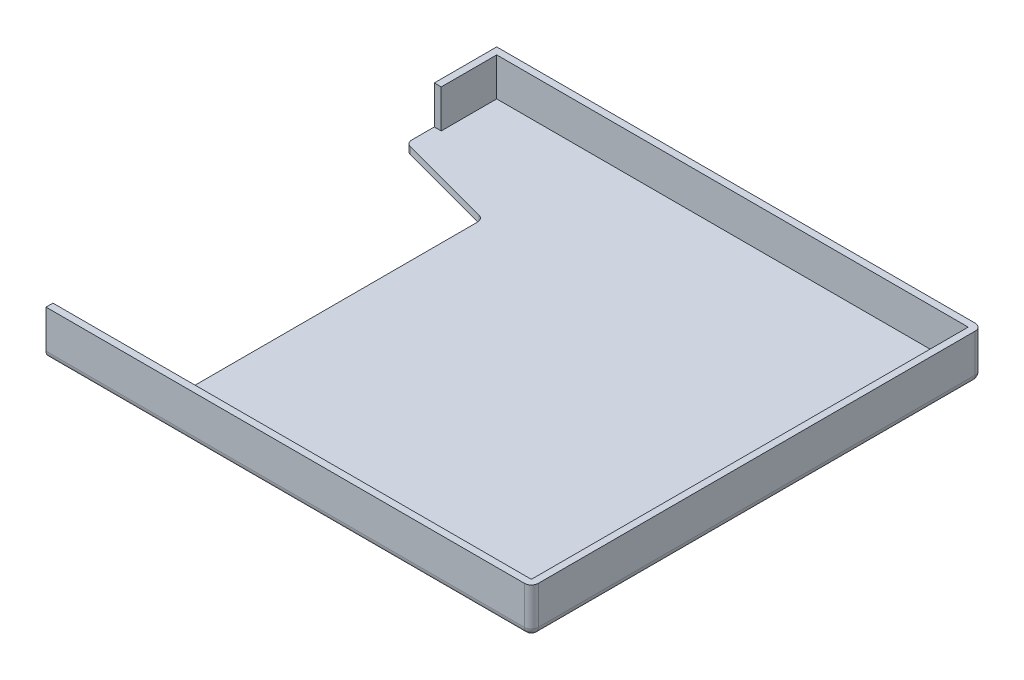
ISO-10303-21;
HEADER;
FILE_DESCRIPTION(('STEP AP214'),'2;1');
FILE_NAME('part.step','',(''),(''),'','','');
FILE_SCHEMA(('AUTOMOTIVE_DESIGN { 1 0 10303 214 1 1 1 1 }'));
ENDSEC;
DATA;
#1=APPLICATION_CONTEXT('core data for automotive mechanical design processes');
#2=APPLICATION_PROTOCOL_DEFINITION('international standard','automotive_design',2000,#1);
#3=PRODUCT_CONTEXT('',#1,'mechanical');
#4=PRODUCT('Part','Part','',(#3));
#5=PRODUCT_RELATED_PRODUCT_CATEGORY('part','',(#4));
#6=PRODUCT_DEFINITION_FORMATION('','',#4);
#7=PRODUCT_DEFINITION_CONTEXT('part definition',#1,'design');
#8=PRODUCT_DEFINITION('design','',#6,#7);
#9=PRODUCT_DEFINITION_SHAPE('','',#8);
#10=(LENGTH_UNIT() NAMED_UNIT(*) SI_UNIT(.MILLI.,.METRE.));
#11=(NAMED_UNIT(*) PLANE_ANGLE_UNIT() SI_UNIT($,.RADIAN.));
#12=(NAMED_UNIT(*) SI_UNIT($,.STERADIAN.) SOLID_ANGLE_UNIT());
#13=UNCERTAINTY_MEASURE_WITH_UNIT(LENGTH_MEASURE(1.E-05),#10,'distance_accuracy_value','');
#14=(GEOMETRIC_REPRESENTATION_CONTEXT(3) GLOBAL_UNCERTAINTY_ASSIGNED_CONTEXT((#13)) GLOBAL_UNIT_ASSIGNED_CONTEXT((#10,
#11,#12)) REPRESENTATION_CONTEXT('',''));
#15=CARTESIAN_POINT('',(0.,0.,0.));
#16=DIRECTION('',(0.,0.,1.));
#17=DIRECTION('',(1.,0.,0.));
#18=AXIS2_PLACEMENT_3D('',#15,#16,#17);
#19=CARTESIAN_POINT('',(-27.6999999999924,-9.84999999998331,-0.0500000000218383));
#20=DIRECTION('',(-4.61852778244149E-13,-1.,1.09356967925598E-13));
#21=DIRECTION('',(1.,-4.52970994047146E-13,0.));
#22=AXIS2_PLACEMENT_3D('',#19,#20,#21);
#23=SPHERICAL_SURFACE('',#22,0.199999999999965);
#24=CARTESIAN_POINT('',(-27.6999999999925,-9.84999999998327,-0.050000000021771));
#25=DIRECTION('',(-1.,0.,-1.52114091665848E-12));
#26=DIRECTION('',(0.,-1.,-1.37043154602149E-13));
#27=AXIS2_PLACEMENT_3D('',#24,#25,#26);
#28=CIRCLE('',#27,0.200000000000027);
#29=CARTESIAN_POINT('',(-27.6999999999922,-9.84999999998325,-0.250000000021798));
#30=VERTEX_POINT('',#29);
#31=CARTESIAN_POINT('',(-27.6999999999925,-10.0499999999833,-0.0500000000217948));
#32=VERTEX_POINT('',#31);
#33=EDGE_CURVE('E11',#30,#32,#28,.T.);
#34=ORIENTED_EDGE('',*,*,#33,.F.);
#35=CARTESIAN_POINT('',(-27.6999999999924,-9.84999999998325,-0.0500000000218987));
#36=DIRECTION('',(0.,1.,0.));
#37=DIRECTION('',(9.99200722163144E-13,0.,-1.));
#38=AXIS2_PLACEMENT_3D('',#35,#36,#37);
#39=CIRCLE('',#38,0.199999999999899);
#40=CARTESIAN_POINT('',(-27.4999999999925,-9.84999999998325,-0.0500000000215781));
#41=VERTEX_POINT('',#40);
#42=EDGE_CURVE('E42',#41,#30,#39,.T.);
#43=ORIENTED_EDGE('',*,*,#42,.F.);
#44=CARTESIAN_POINT('',(-27.6999999999925,-9.84999999998323,-0.0500000000217939));
#45=DIRECTION('',(-1.07908473823099E-12,0.,1.));
#46=DIRECTION('',(1.,-1.22124532708724E-13,1.07908473823099E-12));
#47=AXIS2_PLACEMENT_3D('',#44,#45,#46);
#48=CIRCLE('',#47,0.200000000000071);
#49=EDGE_CURVE('E248',#32,#41,#48,.T.);
#50=ORIENTED_EDGE('',*,*,#49,.F.);
#51=EDGE_LOOP('',(#34,#43,#50));
#52=FACE_BOUND('',#51,.T.);
#53=ADVANCED_FACE('F17',(#52),#23,.T.);
#54=CARTESIAN_POINT('',(-38.0499999999924,-9.84999999998325,-0.0500000000328803));
#55=DIRECTION('',(-1.,0.,-1.08801856413217E-12));
#56=DIRECTION('',(1.08801856413217E-12,0.,-1.));
#57=AXIS2_PLACEMENT_3D('',#54,#55,#56);
#58=CYLINDRICAL_SURFACE('',#57,0.200000000000089);
#59=ORIENTED_EDGE('',*,*,#33,.T.);
#60=DIRECTION('',(1.,0.,1.07971703236791E-12));
#61=VECTOR('',#60,1.);
#62=CARTESIAN_POINT('',(-41.4999999999924,-10.0499999999833,-0.0500000000366985));
#63=LINE('',#62,#61);
#64=CARTESIAN_POINT('',(-41.4999999999925,-10.0499999999833,-0.0500000000366949));
#65=VERTEX_POINT('',#64);
#66=EDGE_CURVE('E368',#65,#32,#63,.T.);
#67=ORIENTED_EDGE('',*,*,#66,.F.);
#68=CARTESIAN_POINT('',(-41.4999999999924,-9.84999999998328,-0.050000000036672));
#69=DIRECTION('',(1.,0.,1.11022302462504E-12));
#70=DIRECTION('',(1.11022302462503E-12,1.27675647831879E-13,-1.));
#71=AXIS2_PLACEMENT_3D('',#68,#69,#70);
#72=CIRCLE('',#71,0.200000000000022);
#73=CARTESIAN_POINT('',(-41.4999999999922,-9.84999999998325,-0.250000000036694));
#74=VERTEX_POINT('',#73);
#75=EDGE_CURVE('E28',#65,#74,#72,.T.);
#76=ORIENTED_EDGE('',*,*,#75,.T.);
#77=DIRECTION('',(1.,0.,1.0794178554206E-12));
#78=VECTOR('',#77,1.);
#79=CARTESIAN_POINT('',(-41.4999999999922,-9.84999999998325,-0.250000000036694));
#80=LINE('',#79,#78);
#81=EDGE_CURVE('E222',#74,#30,#80,.T.);
#82=ORIENTED_EDGE('',*,*,#81,.T.);
#83=EDGE_LOOP('',(#59,#67,#76,#82));
#84=FACE_BOUND('',#83,.T.);
#85=ADVANCED_FACE('F518',(#84),#58,.T.);
#86=CARTESIAN_POINT('',(-34.4999999999922,-8.74999999998325,-0.250000000029138));
#87=DIRECTION('',(1.07949859368921E-12,0.,-1.));
#88=DIRECTION('',(0.,-1.,0.));
#89=AXIS2_PLACEMENT_3D('',#86,#87,#88);
#90=PLANE('',#89);
#91=ORIENTED_EDGE('',*,*,#81,.F.);
#92=DIRECTION('',(0.,1.,0.));
#93=VECTOR('',#92,1.);
#94=CARTESIAN_POINT('',(-41.4999999999922,-9.84999999998325,-0.250000000036694));
#95=LINE('',#94,#93);
#96=CARTESIAN_POINT('',(-41.4999999999922,-8.74999999998325,-0.250000000036694));
#97=VERTEX_POINT('',#96);
#98=EDGE_CURVE('E217',#74,#97,#95,.T.);
#99=ORIENTED_EDGE('',*,*,#98,.T.);
#100=DIRECTION('',(1.,0.,1.0794178554206E-12));
#101=VECTOR('',#100,1.);
#102=CARTESIAN_POINT('',(-41.4999999999922,-8.74999999998325,-0.250000000036694));
#103=LINE('',#102,#101);
#104=CARTESIAN_POINT('',(-27.6999999999922,-8.74999999998325,-0.250000000021798));
#105=VERTEX_POINT('',#104);
#106=EDGE_CURVE('E204',#97,#105,#103,.T.);
#107=ORIENTED_EDGE('',*,*,#106,.T.);
#108=DIRECTION('',(0.,1.,0.));
#109=VECTOR('',#108,1.);
#110=CARTESIAN_POINT('',(-27.6999999999922,-9.84999999998325,-0.250000000021798));
#111=LINE('',#110,#109);
#112=EDGE_CURVE('E399',#30,#105,#111,.T.);
#113=ORIENTED_EDGE('',*,*,#112,.F.);
#114=EDGE_LOOP('',(#91,#99,#107,#113));
#115=FACE_BOUND('',#114,.T.);
#116=ADVANCED_FACE('F221',(#115),#90,.T.);
#117=CARTESIAN_POINT('',(-41.5000000000062,-8.74999999998325,6.24999999997085));
#118=DIRECTION('',(0.,1.,0.));
#119=DIRECTION('',(1.,0.,0.));
#120=AXIS2_PLACEMENT_3D('',#117,#118,#119);
#121=PLANE('',#120);
#122=ORIENTED_EDGE('',*,*,#106,.F.);
#123=DIRECTION('',(1.11515734917904E-12,0.,-1.));
#124=VECTOR('',#123,1.);
#125=CARTESIAN_POINT('',(-41.4999999999942,-8.74999999998325,1.54999999996331));
#126=LINE('',#125,#124);
#127=CARTESIAN_POINT('',(-41.4999999999942,-8.74999999998325,1.54999999996331));
#128=VERTEX_POINT('',#127);
#129=EDGE_CURVE('E209',#128,#97,#126,.T.);
#130=ORIENTED_EDGE('',*,*,#129,.F.);
#131=DIRECTION('',(-1.,0.,-1.04916075827075E-12));
#132=VECTOR('',#131,1.);
#133=CARTESIAN_POINT('',(-41.2999999999942,-8.74999999998325,1.54999999996352));
#134=LINE('',#133,#132);
#135=CARTESIAN_POINT('',(-41.2999999999942,-8.74999999998325,1.54999999996352));
#136=VERTEX_POINT('',#135);
#137=EDGE_CURVE('E295',#136,#128,#134,.T.);
#138=ORIENTED_EDGE('',*,*,#137,.F.);
#139=DIRECTION('',(-1.12132525487141E-12,0.,1.));
#140=VECTOR('',#139,1.);
#141=CARTESIAN_POINT('',(-41.2999999999924,-8.74999999998325,-0.0500000000364782));
#142=LINE('',#141,#140);
#143=CARTESIAN_POINT('',(-41.2999999999924,-8.74999999998325,-0.0500000000364782));
#144=VERTEX_POINT('',#143);
#145=EDGE_CURVE('E319',#144,#136,#142,.T.);
#146=ORIENTED_EDGE('',*,*,#145,.F.);
#147=DIRECTION('',(-1.,0.,-1.07939660579746E-12));
#148=VECTOR('',#147,1.);
#149=CARTESIAN_POINT('',(-27.6999999999924,-8.74999999998325,-0.0500000000217984));
#150=LINE('',#149,#148);
#151=CARTESIAN_POINT('',(-27.6999999999924,-8.74999999998325,-0.0500000000217984));
#152=VERTEX_POINT('',#151);
#153=EDGE_CURVE('E323',#152,#144,#150,.T.);
#154=ORIENTED_EDGE('',*,*,#153,.F.);
#155=DIRECTION('',(1.07920727028642E-12,0.,-1.));
#156=VECTOR('',#155,1.);
#157=CARTESIAN_POINT('',(-27.700000000006,-8.74999999998325,12.5499999999782));
#158=LINE('',#157,#156);
#159=CARTESIAN_POINT('',(-27.700000000006,-8.74999999998325,12.5499999999782));
#160=VERTEX_POINT('',#159);
#161=EDGE_CURVE('E250',#160,#152,#158,.T.);
#162=ORIENTED_EDGE('',*,*,#161,.F.);
#163=DIRECTION('',(1.,0.,1.07981256786368E-12));
#164=VECTOR('',#163,1.);
#165=CARTESIAN_POINT('',(-41.5000000000061,-8.74999999998325,12.5499999999633));
#166=LINE('',#165,#164);
#167=CARTESIAN_POINT('',(-41.5000000000061,-8.74999999998325,12.5499999999633));
#168=VERTEX_POINT('',#167);
#169=EDGE_CURVE('E262',#168,#160,#166,.T.);
#170=ORIENTED_EDGE('',*,*,#169,.F.);
#171=DIRECTION('',(1.02140518265513E-12,0.,-1.));
#172=VECTOR('',#171,1.);
#173=CARTESIAN_POINT('',(-41.5000000000063,-8.74999999998325,12.7499999999633));
#174=LINE('',#173,#172);
#175=CARTESIAN_POINT('',(-41.5000000000063,-8.74999999998325,12.7499999999633));
#176=VERTEX_POINT('',#175);
#177=EDGE_CURVE('E318',#176,#168,#174,.T.);
#178=ORIENTED_EDGE('',*,*,#177,.F.);
#179=DIRECTION('',(-1.,0.,-1.07965166597606E-12));
#180=VECTOR('',#179,1.);
#181=CARTESIAN_POINT('',(-27.7000000000063,-8.74999999998325,12.7499999999782));
#182=LINE('',#181,#180);
#183=CARTESIAN_POINT('',(-27.7000000000063,-8.74999999998325,12.7499999999782));
#184=VERTEX_POINT('',#183);
#185=EDGE_CURVE('E273',#184,#176,#182,.T.);
#186=ORIENTED_EDGE('',*,*,#185,.F.);
#187=CARTESIAN_POINT('',(-27.700000000006,-8.74999999998325,12.5499999999782));
#188=DIRECTION('',(0.,-1.,0.));
#189=DIRECTION('',(-9.99200722162662E-13,0.,1.));
#190=AXIS2_PLACEMENT_3D('',#187,#188,#189);
#191=CIRCLE('',#190,0.199999999999996);
#192=CARTESIAN_POINT('',(-27.500000000006,-8.74999999998325,12.5499999999784));
#193=VERTEX_POINT('',#192);
#194=EDGE_CURVE('E386',#193,#184,#191,.T.);
#195=ORIENTED_EDGE('',*,*,#194,.F.);
#196=DIRECTION('',(-1.07955972204027E-12,0.,1.));
#197=VECTOR('',#196,1.);
#198=CARTESIAN_POINT('',(-27.4999999999924,-8.74999999998325,-0.0500000000215781));
#199=LINE('',#198,#197);
#200=CARTESIAN_POINT('',(-27.4999999999924,-8.74999999998325,-0.0500000000215781));
#201=VERTEX_POINT('',#200);
#202=EDGE_CURVE('E280',#201,#193,#199,.T.);
#203=ORIENTED_EDGE('',*,*,#202,.F.);
#204=CARTESIAN_POINT('',(-27.6999999999924,-8.74999999998325,-0.0500000000218987));
#205=DIRECTION('',(0.,-1.,0.));
#206=DIRECTION('',(1.,0.,1.60284112371649E-12));
#207=AXIS2_PLACEMENT_3D('',#204,#205,#206);
#208=CIRCLE('',#207,0.199999999999898);
#209=EDGE_CURVE('E213',#105,#201,#208,.T.);
#210=ORIENTED_EDGE('',*,*,#209,.F.);
#211=EDGE_LOOP('',(#122,#130,#138,#146,#154,#162,#170,#178,#186,#195,#203,#210));
#212=FACE_BOUND('',#211,.T.);
#213=ADVANCED_FACE('F206',(#212),#121,.T.);
#214=CARTESIAN_POINT('',(-27.4999999999993,-8.74999999998325,6.24999999997841));
#215=DIRECTION('',(1.,0.,0.));
#216=DIRECTION('',(0.,-1.08460249328765E-12,1.));
#217=AXIS2_PLACEMENT_3D('',#214,#215,#216);
#218=PLANE('',#217);
#219=DIRECTION('',(-1.07955972204027E-12,0.,1.));
#220=VECTOR('',#219,1.);
#221=CARTESIAN_POINT('',(-27.4999999999924,-9.84999999998325,-0.0500000000215781));
#222=LINE('',#221,#220);
#223=CARTESIAN_POINT('',(-27.500000000006,-9.84999999998325,12.5499999999784));
#224=VERTEX_POINT('',#223);
#225=EDGE_CURVE('E246',#41,#224,#222,.T.);
#226=ORIENTED_EDGE('',*,*,#225,.F.);
#227=DIRECTION('',(0.,1.,0.));
#228=VECTOR('',#227,1.);
#229=CARTESIAN_POINT('',(-27.4999999999925,-9.84999999998325,-0.0500000000215781));
#230=LINE('',#229,#228);
#231=EDGE_CURVE('E218',#41,#201,#230,.T.);
#232=ORIENTED_EDGE('',*,*,#231,.T.);
#233=ORIENTED_EDGE('',*,*,#202,.T.);
#234=DIRECTION('',(0.,-1.,0.));
#235=VECTOR('',#234,1.);
#236=CARTESIAN_POINT('',(-27.500000000006,-8.74999999998325,12.5499999999784));
#237=LINE('',#236,#235);
#238=EDGE_CURVE('E284',#193,#224,#237,.T.);
#239=ORIENTED_EDGE('',*,*,#238,.T.);
#240=EDGE_LOOP('',(#226,#232,#233,#239));
#241=FACE_BOUND('',#240,.T.);
#242=ADVANCED_FACE('F523',(#241),#218,.T.);
#243=CARTESIAN_POINT('',(-27.700000000006,-9.02499999998325,12.5499999999781));
#244=DIRECTION('',(0.,1.,0.));
#245=DIRECTION('',(-9.99200722162274E-13,0.,1.));
#246=AXIS2_PLACEMENT_3D('',#243,#244,#245);
#247=CYLINDRICAL_SURFACE('',#246,0.200000000000073);
#248=CARTESIAN_POINT('',(-27.700000000006,-9.84999999998325,12.5499999999782));
#249=DIRECTION('',(0.,1.,0.));
#250=DIRECTION('',(1.,0.,1.19904086659493E-12));
#251=AXIS2_PLACEMENT_3D('',#248,#249,#250);
#252=CIRCLE('',#251,0.20000000000004);
#253=CARTESIAN_POINT('',(-27.7000000000063,-9.84999999998325,12.7499999999782));
#254=VERTEX_POINT('',#253);
#255=EDGE_CURVE('E301',#254,#224,#252,.T.);
#256=ORIENTED_EDGE('',*,*,#255,.T.);
#257=ORIENTED_EDGE('',*,*,#238,.F.);
#258=ORIENTED_EDGE('',*,*,#194,.T.);
#259=DIRECTION('',(0.,-1.,0.));
#260=VECTOR('',#259,1.);
#261=CARTESIAN_POINT('',(-27.7000000000063,-8.74999999998325,12.7499999999782));
#262=LINE('',#261,#260);
#263=EDGE_CURVE('E413',#184,#254,#262,.T.);
#264=ORIENTED_EDGE('',*,*,#263,.T.);
#265=EDGE_LOOP('',(#256,#257,#258,#264));
#266=FACE_BOUND('',#265,.T.);
#267=ADVANCED_FACE('F526',(#266),#247,.T.);
#268=CARTESIAN_POINT('',(-27.7000000000061,-9.84999999998322,12.5499999999781));
#269=DIRECTION('',(0.,0.,1.));
#270=DIRECTION('',(1.,0.,0.));
#271=AXIS2_PLACEMENT_3D('',#268,#269,#270);
#272=SPHERICAL_SURFACE('',#271,0.200000000000117);
#273=CARTESIAN_POINT('',(-27.700000000006,-9.84999999998325,12.5499999999782));
#274=DIRECTION('',(9.8205714807643E-13,0.,-1.));
#275=DIRECTION('',(-7.10542735760261E-13,-1.,0.));
#276=AXIS2_PLACEMENT_3D('',#273,#274,#275);
#277=CIRCLE('',#276,0.199999999999955);
#278=CARTESIAN_POINT('',(-27.7000000000061,-10.0499999999832,12.5499999999782));
#279=VERTEX_POINT('',#278);
#280=EDGE_CURVE('E305',#224,#279,#277,.T.);
#281=ORIENTED_EDGE('',*,*,#280,.F.);
#282=ORIENTED_EDGE('',*,*,#255,.F.);
#283=CARTESIAN_POINT('',(-27.700000000006,-9.84999999998328,12.5499999999782));
#284=DIRECTION('',(-1.,0.,-1.50990331349003E-12));
#285=DIRECTION('',(-1.50990331349003E-12,1.16573417585627E-13,1.));
#286=AXIS2_PLACEMENT_3D('',#283,#284,#285);
#287=CIRCLE('',#286,0.200000000000025);
#288=EDGE_CURVE('E272',#279,#254,#287,.T.);
#289=ORIENTED_EDGE('',*,*,#288,.F.);
#290=EDGE_LOOP('',(#281,#282,#289));
#291=FACE_BOUND('',#290,.T.);
#292=ADVANCED_FACE('F531',(#291),#272,.T.);
#293=CARTESIAN_POINT('',(-38.0500000000061,-9.84999999998325,12.549999999967));
#294=DIRECTION('',(1.,0.,1.08801856413219E-12));
#295=DIRECTION('',(-1.08801856413219E-12,0.,1.));
#296=AXIS2_PLACEMENT_3D('',#293,#294,#295);
#297=CYLINDRICAL_SURFACE('',#296,0.200000000000085);
#298=CARTESIAN_POINT('',(-41.500000000006,-9.84999999998328,12.5499999999633));
#299=DIRECTION('',(1.,0.,1.50543999207157E-12));
#300=DIRECTION('',(0.,-1.,1.11022302462502E-13));
#301=AXIS2_PLACEMENT_3D('',#298,#299,#300);
#302=CIRCLE('',#301,0.200000000000025);
#303=CARTESIAN_POINT('',(-41.5000000000063,-9.84999999998325,12.7499999999633));
#304=VERTEX_POINT('',#303);
#305=CARTESIAN_POINT('',(-41.500000000006,-10.0499999999833,12.5499999999633));
#306=VERTEX_POINT('',#305);
#307=EDGE_CURVE('E342',#304,#306,#302,.T.);
#308=ORIENTED_EDGE('',*,*,#307,.T.);
#309=DIRECTION('',(-1.,0.,-1.07981256786368E-12));
#310=VECTOR('',#309,1.);
#311=CARTESIAN_POINT('',(-27.700000000006,-10.0499999999833,12.5499999999782));
#312=LINE('',#311,#310);
#313=EDGE_CURVE('E396',#279,#306,#312,.T.);
#314=ORIENTED_EDGE('',*,*,#313,.F.);
#315=ORIENTED_EDGE('',*,*,#288,.T.);
#316=DIRECTION('',(-1.,0.,-1.07965166597606E-12));
#317=VECTOR('',#316,1.);
#318=CARTESIAN_POINT('',(-27.7000000000063,-9.84999999998325,12.7499999999782));
#319=LINE('',#318,#317);
#320=EDGE_CURVE('E269',#254,#304,#319,.T.);
#321=ORIENTED_EDGE('',*,*,#320,.T.);
#322=EDGE_LOOP('',(#308,#314,#315,#321));
#323=FACE_BOUND('',#322,.T.);
#324=ADVANCED_FACE('F537',(#323),#297,.T.);
#325=CARTESIAN_POINT('',(-34.5000000000063,-8.74999999998325,12.7499999999709));
#326=DIRECTION('',(0.,0.,1.));
#327=DIRECTION('',(1.,1.07850236677872E-12,0.));
#328=AXIS2_PLACEMENT_3D('',#325,#326,#327);
#329=PLANE('',#328);
#330=ORIENTED_EDGE('',*,*,#263,.F.);
#331=ORIENTED_EDGE('',*,*,#185,.T.);
#332=DIRECTION('',(0.,1.,0.));
#333=VECTOR('',#332,1.);
#334=CARTESIAN_POINT('',(-41.5000000000063,-9.84999999998325,12.7499999999633));
#335=LINE('',#334,#333);
#336=EDGE_CURVE('E395',#304,#176,#335,.T.);
#337=ORIENTED_EDGE('',*,*,#336,.F.);
#338=ORIENTED_EDGE('',*,*,#320,.F.);
#339=EDGE_LOOP('',(#330,#331,#337,#338));
#340=FACE_BOUND('',#339,.T.);
#341=ADVANCED_FACE('F534',(#340),#329,.T.);
#342=CARTESIAN_POINT('',(-41.5000000000058,-8.74999999998325,12.2999999999633));
#343=DIRECTION('',(-1.,0.,-1.10528870007127E-12));
#344=DIRECTION('',(-1.10528870007127E-12,0.,1.));
#345=AXIS2_PLACEMENT_3D('',#342,#343,#344);
#346=PLANE('',#345);
#347=DIRECTION('',(0.,1.,0.));
#348=VECTOR('',#347,1.);
#349=CARTESIAN_POINT('',(-41.5000000000061,-9.74999999998325,12.5499999999633));
#350=LINE('',#349,#348);
#351=CARTESIAN_POINT('',(-41.5000000000061,-9.84999999998325,12.5499999999633));
#352=VERTEX_POINT('',#351);
#353=EDGE_CURVE('E244',#352,#168,#350,.T.);
#354=ORIENTED_EDGE('',*,*,#353,.F.);
#355=DIRECTION('',(1.19015908239817E-12,0.,-1.));
#356=VECTOR('',#355,1.);
#357=CARTESIAN_POINT('',(-41.5000000000061,-9.84999999998325,12.5499999999633));
#358=LINE('',#357,#356);
#359=CARTESIAN_POINT('',(-41.5000000000055,-9.84999999998325,12.0499999999633));
#360=VERTEX_POINT('',#359);
#361=EDGE_CURVE('E353',#352,#360,#358,.T.);
#362=ORIENTED_EDGE('',*,*,#361,.T.);
#363=DIRECTION('',(0.,-1.,0.));
#364=VECTOR('',#363,1.);
#365=CARTESIAN_POINT('',(-41.5000000000055,-9.84999999998325,12.0499999999633));
#366=LINE('',#365,#364);
#367=CARTESIAN_POINT('',(-41.5000000000055,-10.0499999999833,12.0499999999633));
#368=VERTEX_POINT('',#367);
#369=EDGE_CURVE('E362',#360,#368,#366,.T.);
#370=ORIENTED_EDGE('',*,*,#369,.T.);
#371=DIRECTION('',(9.94759830064144E-13,0.,-1.));
#372=VECTOR('',#371,1.);
#373=CARTESIAN_POINT('',(-41.500000000006,-10.0499999999833,12.5499999999633));
#374=LINE('',#373,#372);
#375=EDGE_CURVE('E308',#306,#368,#374,.T.);
#376=ORIENTED_EDGE('',*,*,#375,.F.);
#377=ORIENTED_EDGE('',*,*,#307,.F.);
#378=ORIENTED_EDGE('',*,*,#336,.T.);
#379=ORIENTED_EDGE('',*,*,#177,.T.);
#380=EDGE_LOOP('',(#354,#362,#370,#376,#377,#378,#379));
#381=FACE_BOUND('',#380,.T.);
#382=ADVANCED_FACE('F540',(#381),#346,.T.);
#383=CARTESIAN_POINT('',(-41.3000000000055,-9.94999999998327,12.0499999999635));
#384=DIRECTION('',(0.,1.,0.));
#385=DIRECTION('',(9.76996261670029E-13,0.,-1.));
#386=AXIS2_PLACEMENT_3D('',#383,#384,#385);
#387=CYLINDRICAL_SURFACE('',#386,0.200000000000022);
#388=CARTESIAN_POINT('',(-41.3000000000055,-10.0499999999833,12.0499999999635));
#389=DIRECTION('',(0.,1.,0.));
#390=DIRECTION('',(-1.,0.,-9.8809849191641E-13));
#391=AXIS2_PLACEMENT_3D('',#388,#389,#390);
#392=CIRCLE('',#391,0.199999999999996);
#393=CARTESIAN_POINT('',(-41.3000000000053,-10.0499999999833,11.8499999999635));
#394=VERTEX_POINT('',#393);
#395=EDGE_CURVE('E314',#394,#368,#392,.T.);
#396=ORIENTED_EDGE('',*,*,#395,.T.);
#397=ORIENTED_EDGE('',*,*,#369,.F.);
#398=CARTESIAN_POINT('',(-41.3000000000055,-9.84999999998325,12.0499999999635));
#399=DIRECTION('',(0.,-1.,0.));
#400=DIRECTION('',(1.02140518265515E-12,0.,-1.));
#401=AXIS2_PLACEMENT_3D('',#398,#399,#400);
#402=CIRCLE('',#401,0.2);
#403=CARTESIAN_POINT('',(-41.3000000000053,-9.84999999998325,11.8499999999635));
#404=VERTEX_POINT('',#403);
#405=EDGE_CURVE('E312',#360,#404,#402,.T.);
#406=ORIENTED_EDGE('',*,*,#405,.T.);
#407=DIRECTION('',(0.,-1.,0.));
#408=VECTOR('',#407,1.);
#409=CARTESIAN_POINT('',(-41.3000000000053,-9.84999999998325,11.8499999999635));
#410=LINE('',#409,#408);
#411=EDGE_CURVE('E309',#404,#394,#410,.T.);
#412=ORIENTED_EDGE('',*,*,#411,.T.);
#413=EDGE_LOOP('',(#396,#397,#406,#412));
#414=FACE_BOUND('',#413,.T.);
#415=ADVANCED_FACE('F573',(#414),#387,.T.);
#416=CARTESIAN_POINT('',(-40.0000000000053,-9.84999999998325,11.8499999999649));
#417=DIRECTION('',(1.06655425232323E-12,0.,-1.));
#418=DIRECTION('',(0.,-1.,0.));
#419=AXIS2_PLACEMENT_3D('',#416,#417,#418);
#420=PLANE('',#419);
#421=DIRECTION('',(-1.,0.,-1.0769163338864E-12));
#422=VECTOR('',#421,1.);
#423=CARTESIAN_POINT('',(-38.7000000000053,-9.84999999998325,11.8499999999663));
#424=LINE('',#423,#422);
#425=CARTESIAN_POINT('',(-38.7000000000053,-9.84999999998325,11.8499999999663));
#426=VERTEX_POINT('',#425);
#427=EDGE_CURVE('E405',#426,#404,#424,.T.);
#428=ORIENTED_EDGE('',*,*,#427,.F.);
#429=DIRECTION('',(0.,-1.,0.));
#430=VECTOR('',#429,1.);
#431=CARTESIAN_POINT('',(-38.7000000000053,-9.84999999998325,11.8499999999663));
#432=LINE('',#431,#430);
#433=CARTESIAN_POINT('',(-38.7000000000053,-10.0499999999833,11.8499999999663));
#434=VERTEX_POINT('',#433);
#435=EDGE_CURVE('E313',#426,#434,#432,.T.);
#436=ORIENTED_EDGE('',*,*,#435,.T.);
#437=DIRECTION('',(1.,0.,1.0769163338864E-12));
#438=VECTOR('',#437,1.);
#439=CARTESIAN_POINT('',(-41.3000000000053,-10.0499999999833,11.8499999999635));
#440=LINE('',#439,#438);
#441=EDGE_CURVE('E170',#394,#434,#440,.T.);
#442=ORIENTED_EDGE('',*,*,#441,.F.);
#443=ORIENTED_EDGE('',*,*,#411,.F.);
#444=EDGE_LOOP('',(#428,#436,#442,#443));
#445=FACE_BOUND('',#444,.T.);
#446=ADVANCED_FACE('F543',(#445),#420,.T.);
#447=CARTESIAN_POINT('',(-38.7000000000051,-9.94999999998323,11.6499999999662));
#448=DIRECTION('',(0.,-1.,0.));
#449=DIRECTION('',(1.,0.,1.47659662275097E-12));
#450=AXIS2_PLACEMENT_3D('',#447,#448,#449);
#451=CYLINDRICAL_SURFACE('',#450,0.200000000000067);
#452=CARTESIAN_POINT('',(-38.7000000000051,-10.0499999999833,11.6499999999662));
#453=DIRECTION('',(0.,-1.,0.));
#454=DIRECTION('',(-8.65973959207083E-13,0.,1.));
#455=AXIS2_PLACEMENT_3D('',#452,#453,#454);
#456=CIRCLE('',#455,0.200000000000125);
#457=CARTESIAN_POINT('',(-38.5000000000051,-10.0499999999833,11.6499999999665));
#458=VERTEX_POINT('',#457);
#459=EDGE_CURVE('E346',#458,#434,#456,.T.);
#460=ORIENTED_EDGE('',*,*,#459,.T.);
#461=ORIENTED_EDGE('',*,*,#435,.F.);
#462=CARTESIAN_POINT('',(-38.7000000000051,-9.84999999998325,11.6499999999662));
#463=DIRECTION('',(0.,1.,0.));
#464=DIRECTION('',(1.,0.,1.62092561595172E-12));
#465=AXIS2_PLACEMENT_3D('',#462,#463,#464);
#466=CIRCLE('',#465,0.200000000000125);
#467=CARTESIAN_POINT('',(-38.5000000000051,-9.84999999998325,11.6499999999665));
#468=VERTEX_POINT('',#467);
#469=EDGE_CURVE('E343',#426,#468,#466,.T.);
#470=ORIENTED_EDGE('',*,*,#469,.T.);
#471=DIRECTION('',(0.,-1.,0.));
#472=VECTOR('',#471,1.);
#473=CARTESIAN_POINT('',(-38.500000000005,-9.84999999998325,11.6499999999665));
#474=LINE('',#473,#472);
#475=EDGE_CURVE('E181',#468,#458,#474,.T.);
#476=ORIENTED_EDGE('',*,*,#475,.T.);
#477=EDGE_LOOP('',(#460,#461,#470,#476));
#478=FACE_BOUND('',#477,.T.);
#479=ADVANCED_FACE('F547',(#478),#451,.F.);
#480=CARTESIAN_POINT('',(-38.5000000000006,-9.84999999998325,7.49999999996652));
#481=DIRECTION('',(-1.,0.,-1.09184691938999E-12));
#482=DIRECTION('',(-1.09184691938999E-12,0.,1.));
#483=AXIS2_PLACEMENT_3D('',#480,#481,#482);
#484=PLANE('',#483);
#485=DIRECTION('',(1.09075643586263E-12,0.,-1.));
#486=VECTOR('',#485,1.);
#487=CARTESIAN_POINT('',(-38.5000000000051,-10.0499999999833,11.6499999999665));
#488=LINE('',#487,#486);
#489=CARTESIAN_POINT('',(-38.499999999996,-10.0499999999833,3.30365566258336));
#490=VERTEX_POINT('',#489);
#491=EDGE_CURVE('E240',#458,#490,#488,.T.);
#492=ORIENTED_EDGE('',*,*,#491,.F.);
#493=ORIENTED_EDGE('',*,*,#475,.F.);
#494=DIRECTION('',(-1.09075643586263E-12,0.,1.));
#495=VECTOR('',#494,1.);
#496=CARTESIAN_POINT('',(-38.499999999996,-9.84999999998325,3.30365566258336));
#497=LINE('',#496,#495);
#498=CARTESIAN_POINT('',(-38.499999999996,-9.84999999998325,3.30365566258336));
#499=VERTEX_POINT('',#498);
#500=EDGE_CURVE('E408',#499,#468,#497,.T.);
#501=ORIENTED_EDGE('',*,*,#500,.F.);
#502=DIRECTION('',(0.,-1.,0.));
#503=VECTOR('',#502,1.);
#504=CARTESIAN_POINT('',(-38.499999999996,-9.84999999998325,3.30365566258336));
#505=LINE('',#504,#503);
#506=EDGE_CURVE('E260',#499,#490,#505,.T.);
#507=ORIENTED_EDGE('',*,*,#506,.T.);
#508=EDGE_LOOP('',(#492,#493,#501,#507));
#509=FACE_BOUND('',#508,.T.);
#510=ADVANCED_FACE('F548',(#509),#484,.T.);
#511=CARTESIAN_POINT('',(-38.699999999996,-9.94999999998328,3.3036556625831));
#512=DIRECTION('',(0.,-1.,0.));
#513=DIRECTION('',(0.257662650561319,0.,-0.966234939600983));
#514=AXIS2_PLACEMENT_3D('',#511,#512,#513);
#515=CYLINDRICAL_SURFACE('',#514,0.199999999999957);
#516=CARTESIAN_POINT('',(-38.6999999999959,-10.0499999999833,3.30365566258309));
#517=DIRECTION('',(0.,-1.,0.));
#518=DIRECTION('',(1.,0.,1.3378187446737E-12));
#519=AXIS2_PLACEMENT_3D('',#516,#517,#518);
#520=CIRCLE('',#519,0.199999999999942);
#521=CARTESIAN_POINT('',(-38.6484674698837,-10.0499999999833,3.11040867466295));
#522=VERTEX_POINT('',#521);
#523=EDGE_CURVE('E256',#522,#490,#520,.T.);
#524=ORIENTED_EDGE('',*,*,#523,.T.);
#525=ORIENTED_EDGE('',*,*,#506,.F.);
#526=CARTESIAN_POINT('',(-38.6999999999959,-9.84999999998325,3.30365566258309));
#527=DIRECTION('',(0.,1.,0.));
#528=DIRECTION('',(0.257662650561293,0.,-0.96623493960099));
#529=AXIS2_PLACEMENT_3D('',#526,#527,#528);
#530=CIRCLE('',#529,0.199999999999943);
#531=CARTESIAN_POINT('',(-38.6484674698837,-9.84999999998325,3.11040867466295));
#532=VERTEX_POINT('',#531);
#533=EDGE_CURVE('E261',#499,#532,#530,.T.);
#534=ORIENTED_EDGE('',*,*,#533,.T.);
#535=DIRECTION('',(0.,-1.,0.));
#536=VECTOR('',#535,1.);
#537=CARTESIAN_POINT('',(-38.6484674698837,-9.84999999998325,3.11040867466295));
#538=LINE('',#537,#536);
#539=EDGE_CURVE('E326',#532,#522,#538,.T.);
#540=ORIENTED_EDGE('',*,*,#539,.T.);
#541=EDGE_LOOP('',(#524,#525,#534,#540));
#542=FACE_BOUND('',#541,.T.);
#543=ADVANCED_FACE('F552',(#542),#515,.F.);
#544=CARTESIAN_POINT('',(-39.9999999999955,-9.84999999998325,2.74999999996492));
#545=DIRECTION('',(-0.257662650561376,0.,0.966234939600968));
#546=DIRECTION('',(0.,1.,0.));
#547=AXIS2_PLACEMENT_3D('',#544,#545,#546);
#548=PLANE('',#547);
#549=DIRECTION('',(-0.966234939600969,0.,-0.257662650561371));
#550=VECTOR('',#549,1.);
#551=CARTESIAN_POINT('',(-38.6484674698837,-10.0499999999833,3.11040867466295));
#552=LINE('',#551,#550);
#553=CARTESIAN_POINT('',(-41.3515325301071,-10.0499999999833,2.38959132526693));
#554=VERTEX_POINT('',#553);
#555=EDGE_CURVE('E367',#522,#554,#552,.T.);
#556=ORIENTED_EDGE('',*,*,#555,.F.);
#557=ORIENTED_EDGE('',*,*,#539,.F.);
#558=DIRECTION('',(0.966234939600969,0.,0.257662650561371));
#559=VECTOR('',#558,1.);
#560=CARTESIAN_POINT('',(-41.3515325301071,-9.84999999998325,2.38959132526693));
#561=LINE('',#560,#559);
#562=CARTESIAN_POINT('',(-41.3515325301071,-9.84999999998325,2.38959132526693));
#563=VERTEX_POINT('',#562);
#564=EDGE_CURVE('E332',#563,#532,#561,.T.);
#565=ORIENTED_EDGE('',*,*,#564,.F.);
#566=DIRECTION('',(0.,1.,0.));
#567=VECTOR('',#566,1.);
#568=CARTESIAN_POINT('',(-41.3515325301071,-10.0499999999833,2.38959132526692));
#569=LINE('',#568,#567);
#570=EDGE_CURVE('E290',#554,#563,#569,.T.);
#571=ORIENTED_EDGE('',*,*,#570,.F.);
#572=EDGE_LOOP('',(#556,#557,#565,#571));
#573=FACE_BOUND('',#572,.T.);
#574=ADVANCED_FACE('F511',(#573),#548,.T.);
#575=CARTESIAN_POINT('',(-41.2999999999948,-9.94999999998328,2.19634433734675));
#576=DIRECTION('',(0.,-1.,0.));
#577=DIRECTION('',(-0.257662650561344,0.,0.966234939600977));
#578=AXIS2_PLACEMENT_3D('',#575,#576,#577);
#579=CYLINDRICAL_SURFACE('',#578,0.199999999999972);
#580=CARTESIAN_POINT('',(-41.2999999999949,-9.84999999998325,2.19634433734679));
#581=DIRECTION('',(0.,-1.,0.));
#582=DIRECTION('',(-1.,0.,-1.40026878980901E-12));
#583=AXIS2_PLACEMENT_3D('',#580,#581,#582);
#584=CIRCLE('',#583,0.199999999999925);
#585=CARTESIAN_POINT('',(-41.4999999999949,-9.84999999998325,2.19634433734651));
#586=VERTEX_POINT('',#585);
#587=EDGE_CURVE('E289',#563,#586,#584,.T.);
#588=ORIENTED_EDGE('',*,*,#587,.T.);
#589=DIRECTION('',(0.,1.,0.));
#590=VECTOR('',#589,1.);
#591=CARTESIAN_POINT('',(-41.4999999999948,-10.0499999999833,2.19634433734651));
#592=LINE('',#591,#590);
#593=CARTESIAN_POINT('',(-41.4999999999949,-10.0499999999833,2.19634433734651));
#594=VERTEX_POINT('',#593);
#595=EDGE_CURVE('E349',#594,#586,#592,.T.);
#596=ORIENTED_EDGE('',*,*,#595,.F.);
#597=CARTESIAN_POINT('',(-41.2999999999949,-10.0499999999833,2.19634433734679));
#598=DIRECTION('',(0.,1.,0.));
#599=DIRECTION('',(-0.257662650561227,0.,0.966234939601008));
#600=AXIS2_PLACEMENT_3D('',#597,#598,#599);
#601=CIRCLE('',#600,0.199999999999925);
#602=EDGE_CURVE('E285',#594,#554,#601,.T.);
#603=ORIENTED_EDGE('',*,*,#602,.T.);
#604=ORIENTED_EDGE('',*,*,#570,.T.);
#605=EDGE_LOOP('',(#588,#596,#603,#604));
#606=FACE_BOUND('',#605,.T.);
#607=ADVANCED_FACE('F515',(#606),#579,.T.);
#608=CARTESIAN_POINT('',(-34.600000000006,-9.84999999998325,12.5499999999708));
#609=DIRECTION('',(0.,1.,0.));
#610=DIRECTION('',(1.,0.,0.));
#611=AXIS2_PLACEMENT_3D('',#608,#609,#610);
#612=PLANE('',#611);
#613=ORIENTED_EDGE('',*,*,#564,.T.);
#614=ORIENTED_EDGE('',*,*,#533,.F.);
#615=ORIENTED_EDGE('',*,*,#500,.T.);
#616=ORIENTED_EDGE('',*,*,#469,.F.);
#617=ORIENTED_EDGE('',*,*,#427,.T.);
#618=ORIENTED_EDGE('',*,*,#405,.F.);
#619=ORIENTED_EDGE('',*,*,#361,.F.);
#620=DIRECTION('',(-1.,0.,-1.07981256786368E-12));
#621=VECTOR('',#620,1.);
#622=CARTESIAN_POINT('',(-27.700000000006,-9.84999999998325,12.5499999999782));
#623=LINE('',#622,#621);
#624=CARTESIAN_POINT('',(-27.700000000006,-9.84999999998325,12.5499999999782));
#625=VERTEX_POINT('',#624);
#626=EDGE_CURVE('E254',#625,#352,#623,.T.);
#627=ORIENTED_EDGE('',*,*,#626,.F.);
#628=DIRECTION('',(-1.07920727028642E-12,0.,1.));
#629=VECTOR('',#628,1.);
#630=CARTESIAN_POINT('',(-27.6999999999924,-9.84999999998325,-0.0500000000217984));
#631=LINE('',#630,#629);
#632=CARTESIAN_POINT('',(-27.6999999999924,-9.84999999998325,-0.0500000000217984));
#633=VERTEX_POINT('',#632);
#634=EDGE_CURVE('E336',#633,#625,#631,.T.);
#635=ORIENTED_EDGE('',*,*,#634,.F.);
#636=DIRECTION('',(1.,0.,1.07913193291417E-12));
#637=VECTOR('',#636,1.);
#638=CARTESIAN_POINT('',(-41.2999999999924,-9.84999999998325,-0.0500000000364746));
#639=LINE('',#638,#637);
#640=CARTESIAN_POINT('',(-41.2999999999924,-9.84999999998325,-0.0500000000364746));
#641=VERTEX_POINT('',#640);
#642=EDGE_CURVE('E339',#641,#633,#639,.T.);
#643=ORIENTED_EDGE('',*,*,#642,.F.);
#644=DIRECTION('',(1.12132525487141E-12,0.,-1.));
#645=VECTOR('',#644,1.);
#646=CARTESIAN_POINT('',(-41.2999999999942,-9.84999999998325,1.54999999996352));
#647=LINE('',#646,#645);
#648=CARTESIAN_POINT('',(-41.2999999999942,-9.84999999998325,1.54999999996352));
#649=VERTEX_POINT('',#648);
#650=EDGE_CURVE('E277',#649,#641,#647,.T.);
#651=ORIENTED_EDGE('',*,*,#650,.F.);
#652=DIRECTION('',(1.,0.,1.04916075827075E-12));
#653=VECTOR('',#652,1.);
#654=CARTESIAN_POINT('',(-41.4999999999942,-9.84999999998325,1.54999999996331));
#655=LINE('',#654,#653);
#656=CARTESIAN_POINT('',(-41.4999999999942,-9.84999999998325,1.54999999996331));
#657=VERTEX_POINT('',#656);
#658=EDGE_CURVE('E278',#657,#649,#655,.T.);
#659=ORIENTED_EDGE('',*,*,#658,.F.);
#660=DIRECTION('',(1.07184224769555E-12,0.,-1.));
#661=VECTOR('',#660,1.);
#662=CARTESIAN_POINT('',(-41.4999999999949,-9.84999999998325,2.19634433734651));
#663=LINE('',#662,#661);
#664=EDGE_CURVE('E239',#586,#657,#663,.T.);
#665=ORIENTED_EDGE('',*,*,#664,.F.);
#666=ORIENTED_EDGE('',*,*,#587,.F.);
#667=EDGE_LOOP('',(#613,#614,#615,#616,#617,#618,#619,#627,#635,#643,#651,#659,#665,#666));
#668=FACE_BOUND('',#667,.T.);
#669=ADVANCED_FACE('F474',(#668),#612,.T.);
#670=CARTESIAN_POINT('',(-34.6002398188394,-9.85299225246059,12.5499999999708));
#671=DIRECTION('',(1.07977524188504E-12,0.,-1.));
#672=DIRECTION('',(0.,-1.,0.));
#673=AXIS2_PLACEMENT_3D('',#670,#671,#672);
#674=PLANE('',#673);
#675=ORIENTED_EDGE('',*,*,#353,.T.);
#676=ORIENTED_EDGE('',*,*,#169,.T.);
#677=DIRECTION('',(0.,-1.,0.));
#678=VECTOR('',#677,1.);
#679=CARTESIAN_POINT('',(-27.700000000006,-8.74999999998325,12.5499999999782));
#680=LINE('',#679,#678);
#681=EDGE_CURVE('E266',#160,#625,#680,.T.);
#682=ORIENTED_EDGE('',*,*,#681,.T.);
#683=ORIENTED_EDGE('',*,*,#626,.T.);
#684=EDGE_LOOP('',(#675,#676,#682,#683));
#685=FACE_BOUND('',#684,.T.);
#686=ADVANCED_FACE('F564',(#685),#674,.T.);
#687=CARTESIAN_POINT('',(-27.6999999999992,-8.74999999998325,6.2499999999782));
#688=DIRECTION('',(-1.,0.,-1.07920727028642E-12));
#689=DIRECTION('',(-1.07920727028642E-12,0.,1.));
#690=AXIS2_PLACEMENT_3D('',#687,#688,#689);
#691=PLANE('',#690);
#692=ORIENTED_EDGE('',*,*,#161,.T.);
#693=DIRECTION('',(0.,-1.,0.));
#694=VECTOR('',#693,1.);
#695=CARTESIAN_POINT('',(-27.6999999999924,-8.74999999998325,-0.0500000000217984));
#696=LINE('',#695,#694);
#697=EDGE_CURVE('E255',#152,#633,#696,.T.);
#698=ORIENTED_EDGE('',*,*,#697,.T.);
#699=ORIENTED_EDGE('',*,*,#634,.T.);
#700=ORIENTED_EDGE('',*,*,#681,.F.);
#701=EDGE_LOOP('',(#692,#698,#699,#700));
#702=FACE_BOUND('',#701,.T.);
#703=ADVANCED_FACE('F19',(#702),#691,.T.);
#704=CARTESIAN_POINT('',(-34.4999999999924,-8.74999999998325,-0.0500000000291365));
#705=DIRECTION('',(0.,0.,1.));
#706=DIRECTION('',(1.,1.07913193291417E-12,0.));
#707=AXIS2_PLACEMENT_3D('',#704,#705,#706);
#708=PLANE('',#707);
#709=DIRECTION('',(0.,1.,0.));
#710=VECTOR('',#709,1.);
#711=CARTESIAN_POINT('',(-41.2999999999924,-9.84999999998325,-0.0500000000364746));
#712=LINE('',#711,#710);
#713=EDGE_CURVE('E274',#641,#144,#712,.T.);
#714=ORIENTED_EDGE('',*,*,#713,.F.);
#715=ORIENTED_EDGE('',*,*,#642,.T.);
#716=ORIENTED_EDGE('',*,*,#697,.F.);
#717=ORIENTED_EDGE('',*,*,#153,.T.);
#718=EDGE_LOOP('',(#714,#715,#716,#717));
#719=FACE_BOUND('',#718,.T.);
#720=ADVANCED_FACE('F465',(#719),#708,.T.);
#721=CARTESIAN_POINT('',(-41.2999999999933,-8.74999999998325,0.749999999963524));
#722=DIRECTION('',(1.,0.,0.));
#723=DIRECTION('',(0.,-1.06026298851703E-12,1.));
#724=AXIS2_PLACEMENT_3D('',#721,#722,#723);
#725=PLANE('',#724);
#726=ORIENTED_EDGE('',*,*,#145,.T.);
#727=DIRECTION('',(0.,1.,0.));
#728=VECTOR('',#727,1.);
#729=CARTESIAN_POINT('',(-41.2999999999942,-9.84999999998325,1.54999999996352));
#730=LINE('',#729,#728);
#731=EDGE_CURVE('E291',#649,#136,#730,.T.);
#732=ORIENTED_EDGE('',*,*,#731,.F.);
#733=ORIENTED_EDGE('',*,*,#650,.T.);
#734=ORIENTED_EDGE('',*,*,#713,.T.);
#735=EDGE_LOOP('',(#726,#732,#733,#734));
#736=FACE_BOUND('',#735,.T.);
#737=ADVANCED_FACE('F467',(#736),#725,.T.);
#738=CARTESIAN_POINT('',(-41.3999999999942,-8.74999999998325,1.54999999996342));
#739=DIRECTION('',(0.,0.,1.));
#740=DIRECTION('',(1.,0.,0.));
#741=AXIS2_PLACEMENT_3D('',#738,#739,#740);
#742=PLANE('',#741);
#743=DIRECTION('',(0.,1.,0.));
#744=VECTOR('',#743,1.);
#745=CARTESIAN_POINT('',(-41.4999999999942,-9.84999999998325,1.54999999996331));
#746=LINE('',#745,#744);
#747=EDGE_CURVE('E21',#657,#128,#746,.T.);
#748=ORIENTED_EDGE('',*,*,#747,.F.);
#749=ORIENTED_EDGE('',*,*,#658,.T.);
#750=ORIENTED_EDGE('',*,*,#731,.T.);
#751=ORIENTED_EDGE('',*,*,#137,.T.);
#752=EDGE_LOOP('',(#748,#749,#750,#751));
#753=FACE_BOUND('',#752,.T.);
#754=ADVANCED_FACE('F590',(#753),#742,.T.);
#755=CARTESIAN_POINT('',(-41.4999999999936,-8.74999999998325,1.04999999996331));
#756=DIRECTION('',(-1.,0.,-1.07947838702015E-12));
#757=DIRECTION('',(-1.07947838702015E-12,0.,1.));
#758=AXIS2_PLACEMENT_3D('',#755,#756,#757);
#759=PLANE('',#758);
#760=ORIENTED_EDGE('',*,*,#98,.F.);
#761=ORIENTED_EDGE('',*,*,#75,.F.);
#762=DIRECTION('',(1.0675485914078E-12,0.,-1.));
#763=VECTOR('',#762,1.);
#764=CARTESIAN_POINT('',(-41.4999999999949,-10.0499999999833,2.19634433734651));
#765=LINE('',#764,#763);
#766=EDGE_CURVE('E363',#594,#65,#765,.T.);
#767=ORIENTED_EDGE('',*,*,#766,.F.);
#768=ORIENTED_EDGE('',*,*,#595,.T.);
#769=ORIENTED_EDGE('',*,*,#664,.T.);
#770=ORIENTED_EDGE('',*,*,#747,.T.);
#771=ORIENTED_EDGE('',*,*,#129,.T.);
#772=EDGE_LOOP('',(#760,#761,#767,#768,#769,#770,#771));
#773=FACE_BOUND('',#772,.T.);
#774=ADVANCED_FACE('F229',(#773),#759,.T.);
#775=CARTESIAN_POINT('',(-34.5000000000063,-10.0499999999833,12.7499999999709));
#776=DIRECTION('',(0.,-1.,0.));
#777=DIRECTION('',(0.,0.,-1.));
#778=AXIS2_PLACEMENT_3D('',#775,#776,#777);
#779=PLANE('',#778);
#780=ORIENTED_EDGE('',*,*,#441,.T.);
#781=ORIENTED_EDGE('',*,*,#459,.F.);
#782=ORIENTED_EDGE('',*,*,#491,.T.);
#783=ORIENTED_EDGE('',*,*,#523,.F.);
#784=ORIENTED_EDGE('',*,*,#555,.T.);
#785=ORIENTED_EDGE('',*,*,#602,.F.);
#786=ORIENTED_EDGE('',*,*,#766,.T.);
#787=ORIENTED_EDGE('',*,*,#66,.T.);
#788=DIRECTION('',(-1.07955972204027E-12,0.,1.));
#789=VECTOR('',#788,1.);
#790=CARTESIAN_POINT('',(-27.6999999999925,-10.0499999999833,-0.0500000000217948));
#791=LINE('',#790,#789);
#792=EDGE_CURVE('E378',#32,#279,#791,.T.);
#793=ORIENTED_EDGE('',*,*,#792,.T.);
#794=ORIENTED_EDGE('',*,*,#313,.T.);
#795=ORIENTED_EDGE('',*,*,#375,.T.);
#796=ORIENTED_EDGE('',*,*,#395,.F.);
#797=EDGE_LOOP('',(#780,#781,#782,#783,#784,#785,#786,#787,#793,#794,#795,#796));
#798=FACE_BOUND('',#797,.T.);
#799=ADVANCED_FACE('F438',(#798),#779,.T.);
#800=CARTESIAN_POINT('',(-27.6999999999992,-9.84999999998325,6.24999999997819));
#801=DIRECTION('',(1.07691633388657E-12,0.,-1.));
#802=DIRECTION('',(1.,0.,1.07691633388657E-12));
#803=AXIS2_PLACEMENT_3D('',#800,#801,#802);
#804=CYLINDRICAL_SURFACE('',#803,0.199999999999969);
#805=ORIENTED_EDGE('',*,*,#280,.T.);
#806=ORIENTED_EDGE('',*,*,#792,.F.);
#807=ORIENTED_EDGE('',*,*,#49,.T.);
#808=ORIENTED_EDGE('',*,*,#225,.T.);
#809=EDGE_LOOP('',(#805,#806,#807,#808));
#810=FACE_BOUND('',#809,.T.);
#811=ADVANCED_FACE('F441',(#810),#804,.T.);
#812=CARTESIAN_POINT('',(-27.6999999999924,-9.02499999998325,-0.050000000021862));
#813=DIRECTION('',(0.,-1.,0.));
#814=DIRECTION('',(1.088018564133E-12,0.,-1.));
#815=AXIS2_PLACEMENT_3D('',#812,#813,#814);
#816=CYLINDRICAL_SURFACE('',#815,0.199999999999936);
#817=ORIENTED_EDGE('',*,*,#209,.T.);
#818=ORIENTED_EDGE('',*,*,#231,.F.);
#819=ORIENTED_EDGE('',*,*,#42,.T.);
#820=ORIENTED_EDGE('',*,*,#112,.T.);
#821=EDGE_LOOP('',(#817,#818,#819,#820));
#822=FACE_BOUND('',#821,.T.);
#823=ADVANCED_FACE('F520',(#822),#816,.T.);
#824=CLOSED_SHELL('',(#53,#85,#116,#213,#242,#267,#292,#324,#341,#382,#415,#446,#479,#510,#543,
#574,#607,#669,#686,#703,#720,#737,#754,#774,#799,#811,#823));
#825=MANIFOLD_SOLID_BREP('B1',#824);
#826=ADVANCED_BREP_SHAPE_REPRESENTATION('',(#18,#825),#14);
#827=SHAPE_DEFINITION_REPRESENTATION(#9,#826);
ENDSEC;
END-ISO-10303-21;
